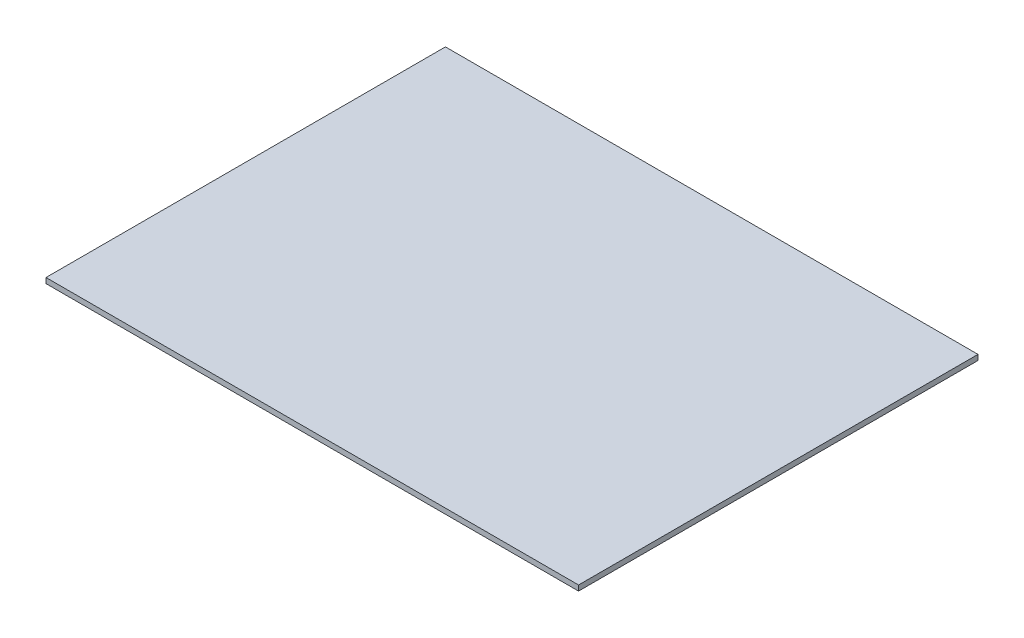
ISO-10303-21;
HEADER;
FILE_DESCRIPTION(('STEP AP214'),'2;1');
FILE_NAME('part.step','',(''),(''),'','','');
FILE_SCHEMA(('AUTOMOTIVE_DESIGN { 1 0 10303 214 1 1 1 1 }'));
ENDSEC;
DATA;
#1=APPLICATION_CONTEXT('core data for automotive mechanical design processes');
#2=APPLICATION_PROTOCOL_DEFINITION('international standard','automotive_design',2000,#1);
#3=PRODUCT_CONTEXT('',#1,'mechanical');
#4=PRODUCT('Part','Part','',(#3));
#5=PRODUCT_RELATED_PRODUCT_CATEGORY('part','',(#4));
#6=PRODUCT_DEFINITION_FORMATION('','',#4);
#7=PRODUCT_DEFINITION_CONTEXT('part definition',#1,'design');
#8=PRODUCT_DEFINITION('design','',#6,#7);
#9=PRODUCT_DEFINITION_SHAPE('','',#8);
#10=(LENGTH_UNIT() NAMED_UNIT(*) SI_UNIT(.MILLI.,.METRE.));
#11=(NAMED_UNIT(*) PLANE_ANGLE_UNIT() SI_UNIT($,.RADIAN.));
#12=(NAMED_UNIT(*) SI_UNIT($,.STERADIAN.) SOLID_ANGLE_UNIT());
#13=UNCERTAINTY_MEASURE_WITH_UNIT(LENGTH_MEASURE(1.E-05),#10,'distance_accuracy_value','');
#14=(GEOMETRIC_REPRESENTATION_CONTEXT(3) GLOBAL_UNCERTAINTY_ASSIGNED_CONTEXT((#13)) GLOBAL_UNIT_ASSIGNED_CONTEXT((#10,
#11,#12)) REPRESENTATION_CONTEXT('',''));
#15=CARTESIAN_POINT('',(0.,0.,0.));
#16=DIRECTION('',(0.,0.,1.));
#17=DIRECTION('',(1.,0.,0.));
#18=AXIS2_PLACEMENT_3D('',#15,#16,#17);
#19=CARTESIAN_POINT('',(200.,4.,150.));
#20=DIRECTION('',(-1.,0.,0.));
#21=DIRECTION('',(0.,0.,1.));
#22=AXIS2_PLACEMENT_3D('',#19,#20,#21);
#23=PLANE('',#22);
#24=DIRECTION('',(0.,0.,-1.));
#25=VECTOR('',#24,1.);
#26=CARTESIAN_POINT('',(200.,0.,150.));
#27=LINE('',#26,#25);
#28=CARTESIAN_POINT('',(200.,0.,150.));
#29=VERTEX_POINT('',#28);
#30=CARTESIAN_POINT('',(200.,0.,-150.));
#31=VERTEX_POINT('',#30);
#32=EDGE_CURVE('E97',#29,#31,#27,.T.);
#33=ORIENTED_EDGE('',*,*,#32,.T.);
#34=DIRECTION('',(0.,-1.,0.));
#35=VECTOR('',#34,1.);
#36=CARTESIAN_POINT('',(200.,4.,-150.));
#37=LINE('',#36,#35);
#38=CARTESIAN_POINT('',(200.,4.,-150.));
#39=VERTEX_POINT('',#38);
#40=EDGE_CURVE('E11',#39,#31,#37,.T.);
#41=ORIENTED_EDGE('',*,*,#40,.F.);
#42=DIRECTION('',(0.,0.,-1.));
#43=VECTOR('',#42,1.);
#44=CARTESIAN_POINT('',(200.,4.,150.));
#45=LINE('',#44,#43);
#46=CARTESIAN_POINT('',(200.,4.,150.));
#47=VERTEX_POINT('',#46);
#48=EDGE_CURVE('E85',#47,#39,#45,.T.);
#49=ORIENTED_EDGE('',*,*,#48,.F.);
#50=DIRECTION('',(0.,-1.,0.));
#51=VECTOR('',#50,1.);
#52=CARTESIAN_POINT('',(200.,4.,150.));
#53=LINE('',#52,#51);
#54=EDGE_CURVE('E93',#47,#29,#53,.T.);
#55=ORIENTED_EDGE('',*,*,#54,.T.);
#56=EDGE_LOOP('',(#33,#41,#49,#55));
#57=FACE_BOUND('',#56,.T.);
#58=ADVANCED_FACE('F34',(#57),#23,.F.);
#59=CARTESIAN_POINT('',(-200.,4.,-150.));
#60=DIRECTION('',(0.,0.,1.));
#61=DIRECTION('',(1.,0.,0.));
#62=AXIS2_PLACEMENT_3D('',#59,#60,#61);
#63=PLANE('',#62);
#64=DIRECTION('',(-1.,0.,0.));
#65=VECTOR('',#64,1.);
#66=CARTESIAN_POINT('',(-200.,0.,-150.));
#67=LINE('',#66,#65);
#68=CARTESIAN_POINT('',(-200.,0.,-150.));
#69=VERTEX_POINT('',#68);
#70=EDGE_CURVE('E89',#31,#69,#67,.T.);
#71=ORIENTED_EDGE('',*,*,#70,.T.);
#72=DIRECTION('',(0.,-1.,0.));
#73=VECTOR('',#72,1.);
#74=CARTESIAN_POINT('',(-200.,4.,-150.));
#75=LINE('',#74,#73);
#76=CARTESIAN_POINT('',(-200.,4.,-150.));
#77=VERTEX_POINT('',#76);
#78=EDGE_CURVE('E42',#77,#69,#75,.T.);
#79=ORIENTED_EDGE('',*,*,#78,.F.);
#80=DIRECTION('',(-1.,0.,0.));
#81=VECTOR('',#80,1.);
#82=CARTESIAN_POINT('',(-200.,4.,-150.));
#83=LINE('',#82,#81);
#84=EDGE_CURVE('E80',#39,#77,#83,.T.);
#85=ORIENTED_EDGE('',*,*,#84,.F.);
#86=ORIENTED_EDGE('',*,*,#40,.T.);
#87=EDGE_LOOP('',(#71,#79,#85,#86));
#88=FACE_BOUND('',#87,.T.);
#89=ADVANCED_FACE('F88',(#88),#63,.F.);
#90=CARTESIAN_POINT('',(-200.,4.,150.));
#91=DIRECTION('',(1.,0.,0.));
#92=DIRECTION('',(0.,0.,-1.));
#93=AXIS2_PLACEMENT_3D('',#90,#91,#92);
#94=PLANE('',#93);
#95=DIRECTION('',(0.,0.,1.));
#96=VECTOR('',#95,1.);
#97=CARTESIAN_POINT('',(-200.,0.,150.));
#98=LINE('',#97,#96);
#99=CARTESIAN_POINT('',(-200.,0.,150.));
#100=VERTEX_POINT('',#99);
#101=EDGE_CURVE('E67',#69,#100,#98,.T.);
#102=ORIENTED_EDGE('',*,*,#101,.T.);
#103=DIRECTION('',(0.,-1.,0.));
#104=VECTOR('',#103,1.);
#105=CARTESIAN_POINT('',(-200.,4.,150.));
#106=LINE('',#105,#104);
#107=CARTESIAN_POINT('',(-200.,4.,150.));
#108=VERTEX_POINT('',#107);
#109=EDGE_CURVE('E90',#108,#100,#106,.T.);
#110=ORIENTED_EDGE('',*,*,#109,.F.);
#111=DIRECTION('',(0.,0.,1.));
#112=VECTOR('',#111,1.);
#113=CARTESIAN_POINT('',(-200.,4.,150.));
#114=LINE('',#113,#112);
#115=EDGE_CURVE('E83',#77,#108,#114,.T.);
#116=ORIENTED_EDGE('',*,*,#115,.F.);
#117=ORIENTED_EDGE('',*,*,#78,.T.);
#118=EDGE_LOOP('',(#102,#110,#116,#117));
#119=FACE_BOUND('',#118,.T.);
#120=ADVANCED_FACE('F91',(#119),#94,.F.);
#121=CARTESIAN_POINT('',(-200.,4.,150.));
#122=DIRECTION('',(0.,0.,-1.));
#123=DIRECTION('',(-1.,0.,0.));
#124=AXIS2_PLACEMENT_3D('',#121,#122,#123);
#125=PLANE('',#124);
#126=DIRECTION('',(1.,0.,0.));
#127=VECTOR('',#126,1.);
#128=CARTESIAN_POINT('',(-200.,0.,150.));
#129=LINE('',#128,#127);
#130=EDGE_CURVE('E73',#100,#29,#129,.T.);
#131=ORIENTED_EDGE('',*,*,#130,.T.);
#132=ORIENTED_EDGE('',*,*,#54,.F.);
#133=DIRECTION('',(1.,0.,0.));
#134=VECTOR('',#133,1.);
#135=CARTESIAN_POINT('',(-200.,4.,150.));
#136=LINE('',#135,#134);
#137=EDGE_CURVE('E50',#108,#47,#136,.T.);
#138=ORIENTED_EDGE('',*,*,#137,.F.);
#139=ORIENTED_EDGE('',*,*,#109,.T.);
#140=EDGE_LOOP('',(#131,#132,#138,#139));
#141=FACE_BOUND('',#140,.T.);
#142=ADVANCED_FACE('F104',(#141),#125,.F.);
#143=CARTESIAN_POINT('',(0.,4.,0.));
#144=DIRECTION('',(0.,-1.,0.));
#145=DIRECTION('',(0.,0.,-1.));
#146=AXIS2_PLACEMENT_3D('',#143,#144,#145);
#147=PLANE('',#146);
#148=ORIENTED_EDGE('',*,*,#48,.T.);
#149=ORIENTED_EDGE('',*,*,#84,.T.);
#150=ORIENTED_EDGE('',*,*,#115,.T.);
#151=ORIENTED_EDGE('',*,*,#137,.T.);
#152=EDGE_LOOP('',(#148,#149,#150,#151));
#153=FACE_BOUND('',#152,.T.);
#154=ADVANCED_FACE('F81',(#153),#147,.F.);
#155=CARTESIAN_POINT('',(0.,0.,0.));
#156=DIRECTION('',(0.,-1.,0.));
#157=DIRECTION('',(0.,0.,-1.));
#158=AXIS2_PLACEMENT_3D('',#155,#156,#157);
#159=PLANE('',#158);
#160=ORIENTED_EDGE('',*,*,#32,.F.);
#161=ORIENTED_EDGE('',*,*,#130,.F.);
#162=ORIENTED_EDGE('',*,*,#101,.F.);
#163=ORIENTED_EDGE('',*,*,#70,.F.);
#164=EDGE_LOOP('',(#160,#161,#162,#163));
#165=FACE_BOUND('',#164,.T.);
#166=ADVANCED_FACE('F107',(#165),#159,.T.);
#167=CLOSED_SHELL('',(#58,#89,#120,#142,#154,#166));
#168=MANIFOLD_SOLID_BREP('B2',#167);
#169=ADVANCED_BREP_SHAPE_REPRESENTATION('',(#18,#168),#14);
#170=SHAPE_DEFINITION_REPRESENTATION(#9,#169);
ENDSEC;
END-ISO-10303-21;
